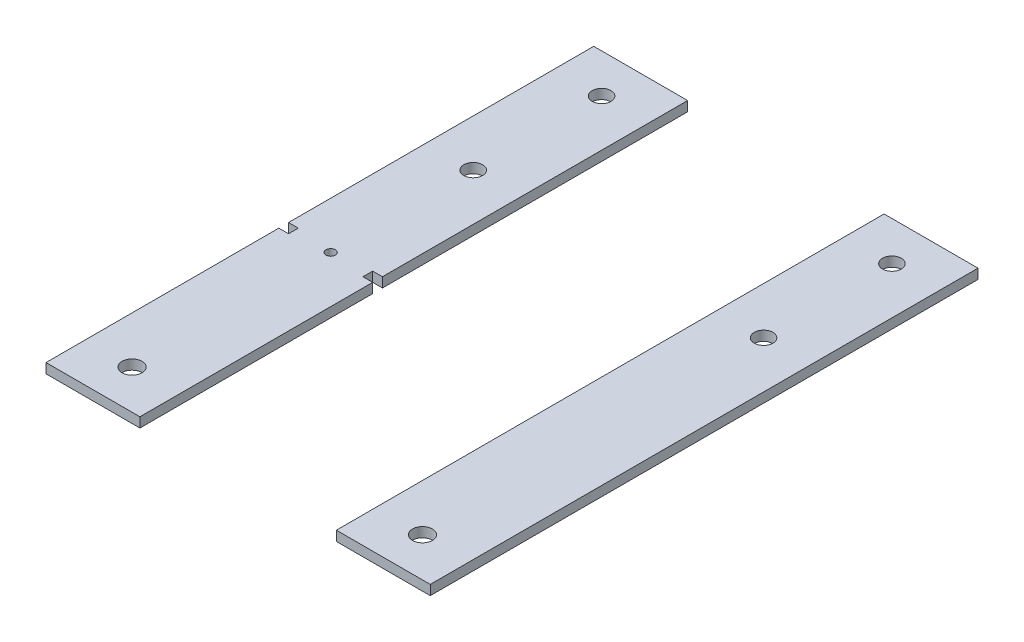
ISO-10303-21;
HEADER;
FILE_DESCRIPTION(('STEP AP214'),'2;1');
FILE_NAME('part.step','',(''),(''),'','','');
FILE_SCHEMA(('AUTOMOTIVE_DESIGN { 1 0 10303 214 1 1 1 1 }'));
ENDSEC;
DATA;
#1=APPLICATION_CONTEXT('core data for automotive mechanical design processes');
#2=APPLICATION_PROTOCOL_DEFINITION('international standard','automotive_design',2000,#1);
#3=PRODUCT_CONTEXT('',#1,'mechanical');
#4=PRODUCT('Part','Part','',(#3));
#5=PRODUCT_RELATED_PRODUCT_CATEGORY('part','',(#4));
#6=PRODUCT_DEFINITION_FORMATION('','',#4);
#7=PRODUCT_DEFINITION_CONTEXT('part definition',#1,'design');
#8=PRODUCT_DEFINITION('design','',#6,#7);
#9=PRODUCT_DEFINITION_SHAPE('','',#8);
#10=(LENGTH_UNIT() NAMED_UNIT(*) SI_UNIT(.MILLI.,.METRE.));
#11=(NAMED_UNIT(*) PLANE_ANGLE_UNIT() SI_UNIT($,.RADIAN.));
#12=(NAMED_UNIT(*) SI_UNIT($,.STERADIAN.) SOLID_ANGLE_UNIT());
#13=UNCERTAINTY_MEASURE_WITH_UNIT(LENGTH_MEASURE(1.E-05),#10,'distance_accuracy_value','');
#14=(GEOMETRIC_REPRESENTATION_CONTEXT(3) GLOBAL_UNCERTAINTY_ASSIGNED_CONTEXT((#13)) GLOBAL_UNIT_ASSIGNED_CONTEXT((#10,
#11,#12)) REPRESENTATION_CONTEXT('',''));
#15=CARTESIAN_POINT('',(0.,0.,0.));
#16=DIRECTION('',(0.,0.,1.));
#17=DIRECTION('',(1.,0.,0.));
#18=AXIS2_PLACEMENT_3D('',#15,#16,#17);
#19=CARTESIAN_POINT('',(-59.189999984,3.175,13.335));
#20=DIRECTION('',(0.,-1.,0.));
#21=DIRECTION('',(0.,0.,-1.));
#22=AXIS2_PLACEMENT_3D('',#19,#20,#21);
#23=PLANE('',#22);
#24=CARTESIAN_POINT('',(-47.1249999840005,3.175,11.7475));
#25=DIRECTION('',(0.,1.,0.));
#26=DIRECTION('',(0.,0.,1.));
#27=AXIS2_PLACEMENT_3D('',#24,#25,#26);
#28=CIRCLE('',#27,1.524);
#29=CARTESIAN_POINT('',(-47.1249999840005,3.175,13.2715));
#30=VERTEX_POINT('',#29);
#31=EDGE_CURVE('E302',#30,#30,#28,.T.);
#32=ORIENTED_EDGE('',*,*,#31,.F.);
#33=EDGE_LOOP('',(#32));
#34=FACE_BOUND('',#33,.T.);
#35=CARTESIAN_POINT('',(-47.1249999840002,3.175,-34.5292679999996));
#36=DIRECTION('',(0.,1.,0.));
#37=DIRECTION('',(0.,0.,-1.));
#38=AXIS2_PLACEMENT_3D('',#35,#36,#37);
#39=CIRCLE('',#38,3.048);
#40=CARTESIAN_POINT('',(-47.1249999840002,3.175,-37.5772679999996));
#41=VERTEX_POINT('',#40);
#42=EDGE_CURVE('E168',#41,#41,#39,.T.);
#43=ORIENTED_EDGE('',*,*,#42,.F.);
#44=EDGE_LOOP('',(#43));
#45=FACE_BOUND('',#44,.T.);
#46=DIRECTION('',(0.,0.,1.));
#47=VECTOR('',#46,1.);
#48=CARTESIAN_POINT('',(-59.189999984,3.175,10.16));
#49=LINE('',#48,#47);
#50=CARTESIAN_POINT('',(-59.189999984,3.175,10.16));
#51=VERTEX_POINT('',#50);
#52=CARTESIAN_POINT('',(-59.189999984,3.175,13.335));
#53=VERTEX_POINT('',#52);
#54=EDGE_CURVE('E187',#51,#53,#49,.T.);
#55=ORIENTED_EDGE('',*,*,#54,.T.);
#56=DIRECTION('',(-1.,0.,0.));
#57=VECTOR('',#56,1.);
#58=CARTESIAN_POINT('',(-59.189999984,3.175,13.335));
#59=LINE('',#58,#57);
#60=CARTESIAN_POINT('',(-62.364999984,3.175,13.335));
#61=VERTEX_POINT('',#60);
#62=EDGE_CURVE('E115',#53,#61,#59,.T.);
#63=ORIENTED_EDGE('',*,*,#62,.T.);
#64=DIRECTION('',(0.,0.,1.));
#65=VECTOR('',#64,1.);
#66=CARTESIAN_POINT('',(-62.364999984,3.175,13.335));
#67=LINE('',#66,#65);
#68=CARTESIAN_POINT('',(-62.364999984,3.175,88.9));
#69=VERTEX_POINT('',#68);
#70=EDGE_CURVE('E214',#61,#69,#67,.T.);
#71=ORIENTED_EDGE('',*,*,#70,.T.);
#72=DIRECTION('',(1.,0.,0.));
#73=VECTOR('',#72,1.);
#74=CARTESIAN_POINT('',(-31.884999984,3.175,88.9));
#75=LINE('',#74,#73);
#76=CARTESIAN_POINT('',(-31.884999984,3.175,88.9));
#77=VERTEX_POINT('',#76);
#78=EDGE_CURVE('E233',#69,#77,#75,.T.);
#79=ORIENTED_EDGE('',*,*,#78,.T.);
#80=DIRECTION('',(0.,0.,-1.));
#81=VECTOR('',#80,1.);
#82=CARTESIAN_POINT('',(-31.884999984,3.175,13.335));
#83=LINE('',#82,#81);
#84=CARTESIAN_POINT('',(-31.884999984,3.175,13.335));
#85=VERTEX_POINT('',#84);
#86=EDGE_CURVE('E230',#77,#85,#83,.T.);
#87=ORIENTED_EDGE('',*,*,#86,.T.);
#88=DIRECTION('',(-1.,0.,0.));
#89=VECTOR('',#88,1.);
#90=CARTESIAN_POINT('',(-31.884999984,3.175,13.335));
#91=LINE('',#90,#89);
#92=CARTESIAN_POINT('',(-35.059999984,3.175,13.335));
#93=VERTEX_POINT('',#92);
#94=EDGE_CURVE('E232',#85,#93,#91,.T.);
#95=ORIENTED_EDGE('',*,*,#94,.T.);
#96=DIRECTION('',(0.,0.,-1.));
#97=VECTOR('',#96,1.);
#98=CARTESIAN_POINT('',(-35.059999984,3.175,13.335));
#99=LINE('',#98,#97);
#100=CARTESIAN_POINT('',(-35.059999984,3.175,10.16));
#101=VERTEX_POINT('',#100);
#102=EDGE_CURVE('E235',#93,#101,#99,.T.);
#103=ORIENTED_EDGE('',*,*,#102,.T.);
#104=DIRECTION('',(1.,0.,0.));
#105=VECTOR('',#104,1.);
#106=CARTESIAN_POINT('',(-35.059999984,3.175,10.16));
#107=LINE('',#106,#105);
#108=CARTESIAN_POINT('',(-31.884999984,3.175,10.16));
#109=VERTEX_POINT('',#108);
#110=EDGE_CURVE('E241',#101,#109,#107,.T.);
#111=ORIENTED_EDGE('',*,*,#110,.T.);
#112=DIRECTION('',(0.,0.,-1.));
#113=VECTOR('',#112,1.);
#114=CARTESIAN_POINT('',(-31.884999984,3.175,-88.9));
#115=LINE('',#114,#113);
#116=CARTESIAN_POINT('',(-31.884999984,3.175,-88.9));
#117=VERTEX_POINT('',#116);
#118=EDGE_CURVE('E146',#109,#117,#115,.T.);
#119=ORIENTED_EDGE('',*,*,#118,.T.);
#120=DIRECTION('',(-1.,0.,0.));
#121=VECTOR('',#120,1.);
#122=CARTESIAN_POINT('',(-31.884999984,3.175,-88.9));
#123=LINE('',#122,#121);
#124=CARTESIAN_POINT('',(-62.364999984,3.175,-88.9));
#125=VERTEX_POINT('',#124);
#126=EDGE_CURVE('E140',#117,#125,#123,.T.);
#127=ORIENTED_EDGE('',*,*,#126,.T.);
#128=DIRECTION('',(0.,0.,1.));
#129=VECTOR('',#128,1.);
#130=CARTESIAN_POINT('',(-62.364999984,3.175,-88.9));
#131=LINE('',#130,#129);
#132=CARTESIAN_POINT('',(-62.364999984,3.175,10.16));
#133=VERTEX_POINT('',#132);
#134=EDGE_CURVE('E144',#125,#133,#131,.T.);
#135=ORIENTED_EDGE('',*,*,#134,.T.);
#136=DIRECTION('',(1.,0.,0.));
#137=VECTOR('',#136,1.);
#138=CARTESIAN_POINT('',(-62.364999984,3.175,10.16));
#139=LINE('',#138,#137);
#140=EDGE_CURVE('E60',#133,#51,#139,.T.);
#141=ORIENTED_EDGE('',*,*,#140,.T.);
#142=EDGE_LOOP('',(#55,#63,#71,#79,#87,#95,#103,#111,#119,#127,#135,#141));
#143=FACE_BOUND('',#142,.T.);
#144=CARTESIAN_POINT('',(-47.1249999840005,3.175,-76.1999999999995));
#145=DIRECTION('',(0.,1.,0.));
#146=DIRECTION('',(0.,0.,-1.));
#147=AXIS2_PLACEMENT_3D('',#144,#145,#146);
#148=CIRCLE('',#147,3.048);
#149=CARTESIAN_POINT('',(-47.1249999840005,3.175,-79.2479999999995));
#150=VERTEX_POINT('',#149);
#151=EDGE_CURVE('E308',#150,#150,#148,.T.);
#152=ORIENTED_EDGE('',*,*,#151,.F.);
#153=EDGE_LOOP('',(#152));
#154=FACE_BOUND('',#153,.T.);
#155=CARTESIAN_POINT('',(-47.1249999840001,3.175,76.2));
#156=DIRECTION('',(0.,1.,0.));
#157=DIRECTION('',(0.,0.,-1.));
#158=AXIS2_PLACEMENT_3D('',#155,#156,#157);
#159=CIRCLE('',#158,3.2385);
#160=CARTESIAN_POINT('',(-47.1249999840001,3.175,72.9615));
#161=VERTEX_POINT('',#160);
#162=EDGE_CURVE('E293',#161,#161,#159,.T.);
#163=ORIENTED_EDGE('',*,*,#162,.F.);
#164=EDGE_LOOP('',(#163));
#165=FACE_BOUND('',#164,.T.);
#166=ADVANCED_FACE('F43',(#34,#45,#143,#154,#165),#23,.F.);
#167=CARTESIAN_POINT('',(-59.189999984,0.,13.335));
#168=DIRECTION('',(0.,-1.,0.));
#169=DIRECTION('',(0.,0.,-1.));
#170=AXIS2_PLACEMENT_3D('',#167,#168,#169);
#171=PLANE('',#170);
#172=CARTESIAN_POINT('',(-47.1249999840005,0.,11.7475));
#173=DIRECTION('',(0.,1.,0.));
#174=DIRECTION('',(0.,0.,1.));
#175=AXIS2_PLACEMENT_3D('',#172,#173,#174);
#176=CIRCLE('',#175,1.524);
#177=CARTESIAN_POINT('',(-47.1249999840005,0.,13.2715));
#178=VERTEX_POINT('',#177);
#179=EDGE_CURVE('E299',#178,#178,#176,.T.);
#180=ORIENTED_EDGE('',*,*,#179,.T.);
#181=EDGE_LOOP('',(#180));
#182=FACE_BOUND('',#181,.T.);
#183=CARTESIAN_POINT('',(-47.1249999840002,0.,-34.5292679999996));
#184=DIRECTION('',(0.,1.,0.));
#185=DIRECTION('',(0.,0.,-1.));
#186=AXIS2_PLACEMENT_3D('',#183,#184,#185);
#187=CIRCLE('',#186,3.048);
#188=CARTESIAN_POINT('',(-47.1249999840002,0.,-37.5772679999996));
#189=VERTEX_POINT('',#188);
#190=EDGE_CURVE('E311',#189,#189,#187,.T.);
#191=ORIENTED_EDGE('',*,*,#190,.T.);
#192=EDGE_LOOP('',(#191));
#193=FACE_BOUND('',#192,.T.);
#194=DIRECTION('',(0.,0.,1.));
#195=VECTOR('',#194,1.);
#196=CARTESIAN_POINT('',(-59.189999984,0.,10.16));
#197=LINE('',#196,#195);
#198=CARTESIAN_POINT('',(-59.189999984,0.,10.16));
#199=VERTEX_POINT('',#198);
#200=CARTESIAN_POINT('',(-59.189999984,0.,13.335));
#201=VERTEX_POINT('',#200);
#202=EDGE_CURVE('E164',#199,#201,#197,.T.);
#203=ORIENTED_EDGE('',*,*,#202,.F.);
#204=DIRECTION('',(1.,0.,0.));
#205=VECTOR('',#204,1.);
#206=CARTESIAN_POINT('',(-62.364999984,0.,10.16));
#207=LINE('',#206,#205);
#208=CARTESIAN_POINT('',(-62.364999984,0.,10.16));
#209=VERTEX_POINT('',#208);
#210=EDGE_CURVE('E107',#209,#199,#207,.T.);
#211=ORIENTED_EDGE('',*,*,#210,.F.);
#212=DIRECTION('',(0.,0.,1.));
#213=VECTOR('',#212,1.);
#214=CARTESIAN_POINT('',(-62.364999984,0.,-88.9));
#215=LINE('',#214,#213);
#216=CARTESIAN_POINT('',(-62.364999984,0.,-88.9));
#217=VERTEX_POINT('',#216);
#218=EDGE_CURVE('E101',#217,#209,#215,.T.);
#219=ORIENTED_EDGE('',*,*,#218,.F.);
#220=DIRECTION('',(-1.,0.,0.));
#221=VECTOR('',#220,1.);
#222=CARTESIAN_POINT('',(-31.884999984,0.,-88.9));
#223=LINE('',#222,#221);
#224=CARTESIAN_POINT('',(-31.884999984,0.,-88.9));
#225=VERTEX_POINT('',#224);
#226=EDGE_CURVE('E154',#225,#217,#223,.T.);
#227=ORIENTED_EDGE('',*,*,#226,.F.);
#228=DIRECTION('',(0.,0.,-1.));
#229=VECTOR('',#228,1.);
#230=CARTESIAN_POINT('',(-31.884999984,0.,-88.9));
#231=LINE('',#230,#229);
#232=CARTESIAN_POINT('',(-31.884999984,0.,10.16));
#233=VERTEX_POINT('',#232);
#234=EDGE_CURVE('E182',#233,#225,#231,.T.);
#235=ORIENTED_EDGE('',*,*,#234,.F.);
#236=DIRECTION('',(1.,0.,0.));
#237=VECTOR('',#236,1.);
#238=CARTESIAN_POINT('',(-35.059999984,0.,10.16));
#239=LINE('',#238,#237);
#240=CARTESIAN_POINT('',(-35.059999984,0.,10.16));
#241=VERTEX_POINT('',#240);
#242=EDGE_CURVE('E180',#241,#233,#239,.T.);
#243=ORIENTED_EDGE('',*,*,#242,.F.);
#244=DIRECTION('',(0.,0.,-1.));
#245=VECTOR('',#244,1.);
#246=CARTESIAN_POINT('',(-35.059999984,0.,13.335));
#247=LINE('',#246,#245);
#248=CARTESIAN_POINT('',(-35.059999984,0.,13.335));
#249=VERTEX_POINT('',#248);
#250=EDGE_CURVE('E178',#249,#241,#247,.T.);
#251=ORIENTED_EDGE('',*,*,#250,.F.);
#252=DIRECTION('',(-1.,0.,0.));
#253=VECTOR('',#252,1.);
#254=CARTESIAN_POINT('',(-31.884999984,0.,13.335));
#255=LINE('',#254,#253);
#256=CARTESIAN_POINT('',(-31.884999984,0.,13.335));
#257=VERTEX_POINT('',#256);
#258=EDGE_CURVE('E176',#257,#249,#255,.T.);
#259=ORIENTED_EDGE('',*,*,#258,.F.);
#260=DIRECTION('',(0.,0.,-1.));
#261=VECTOR('',#260,1.);
#262=CARTESIAN_POINT('',(-31.884999984,0.,13.335));
#263=LINE('',#262,#261);
#264=CARTESIAN_POINT('',(-31.884999984,0.,88.9));
#265=VERTEX_POINT('',#264);
#266=EDGE_CURVE('E174',#265,#257,#263,.T.);
#267=ORIENTED_EDGE('',*,*,#266,.F.);
#268=DIRECTION('',(1.,0.,0.));
#269=VECTOR('',#268,1.);
#270=CARTESIAN_POINT('',(-31.884999984,0.,88.9));
#271=LINE('',#270,#269);
#272=CARTESIAN_POINT('',(-62.364999984,0.,88.9));
#273=VERTEX_POINT('',#272);
#274=EDGE_CURVE('E172',#273,#265,#271,.T.);
#275=ORIENTED_EDGE('',*,*,#274,.F.);
#276=DIRECTION('',(0.,0.,1.));
#277=VECTOR('',#276,1.);
#278=CARTESIAN_POINT('',(-62.364999984,0.,13.335));
#279=LINE('',#278,#277);
#280=CARTESIAN_POINT('',(-62.364999984,0.,13.335));
#281=VERTEX_POINT('',#280);
#282=EDGE_CURVE('E170',#281,#273,#279,.T.);
#283=ORIENTED_EDGE('',*,*,#282,.F.);
#284=DIRECTION('',(-1.,0.,0.));
#285=VECTOR('',#284,1.);
#286=CARTESIAN_POINT('',(-59.189999984,0.,13.335));
#287=LINE('',#286,#285);
#288=EDGE_CURVE('E167',#201,#281,#287,.T.);
#289=ORIENTED_EDGE('',*,*,#288,.F.);
#290=EDGE_LOOP('',(#203,#211,#219,#227,#235,#243,#251,#259,#267,#275,#283,#289));
#291=FACE_BOUND('',#290,.T.);
#292=CARTESIAN_POINT('',(-47.1249999840005,0.,-76.1999999999995));
#293=DIRECTION('',(0.,1.,0.));
#294=DIRECTION('',(0.,0.,-1.));
#295=AXIS2_PLACEMENT_3D('',#292,#293,#294);
#296=CIRCLE('',#295,3.048);
#297=CARTESIAN_POINT('',(-47.1249999840005,0.,-79.2479999999995));
#298=VERTEX_POINT('',#297);
#299=EDGE_CURVE('E305',#298,#298,#296,.T.);
#300=ORIENTED_EDGE('',*,*,#299,.T.);
#301=EDGE_LOOP('',(#300));
#302=FACE_BOUND('',#301,.T.);
#303=CARTESIAN_POINT('',(-47.1249999840001,0.,76.2));
#304=DIRECTION('',(0.,1.,0.));
#305=DIRECTION('',(0.,0.,-1.));
#306=AXIS2_PLACEMENT_3D('',#303,#304,#305);
#307=CIRCLE('',#306,3.2385);
#308=CARTESIAN_POINT('',(-47.1249999840001,0.,72.9615));
#309=VERTEX_POINT('',#308);
#310=EDGE_CURVE('E296',#309,#309,#307,.T.);
#311=ORIENTED_EDGE('',*,*,#310,.T.);
#312=EDGE_LOOP('',(#311));
#313=FACE_BOUND('',#312,.T.);
#314=ADVANCED_FACE('F218',(#182,#193,#291,#302,#313),#171,.T.);
#315=CARTESIAN_POINT('',(-59.189999984,3.175,10.16));
#316=DIRECTION('',(1.,0.,0.));
#317=DIRECTION('',(0.,0.,-1.));
#318=AXIS2_PLACEMENT_3D('',#315,#316,#317);
#319=PLANE('',#318);
#320=ORIENTED_EDGE('',*,*,#202,.T.);
#321=DIRECTION('',(0.,-1.,0.));
#322=VECTOR('',#321,1.);
#323=CARTESIAN_POINT('',(-59.189999984,3.175,13.335));
#324=LINE('',#323,#322);
#325=EDGE_CURVE('E12',#53,#201,#324,.T.);
#326=ORIENTED_EDGE('',*,*,#325,.F.);
#327=ORIENTED_EDGE('',*,*,#54,.F.);
#328=DIRECTION('',(0.,-1.,0.));
#329=VECTOR('',#328,1.);
#330=CARTESIAN_POINT('',(-59.189999984,3.175,10.16));
#331=LINE('',#330,#329);
#332=EDGE_CURVE('E160',#51,#199,#331,.T.);
#333=ORIENTED_EDGE('',*,*,#332,.T.);
#334=EDGE_LOOP('',(#320,#326,#327,#333));
#335=FACE_BOUND('',#334,.T.);
#336=ADVANCED_FACE('F45',(#335),#319,.F.);
#337=CARTESIAN_POINT('',(-59.189999984,3.175,13.335));
#338=DIRECTION('',(0.,0.,1.));
#339=DIRECTION('',(1.,0.,0.));
#340=AXIS2_PLACEMENT_3D('',#337,#338,#339);
#341=PLANE('',#340);
#342=ORIENTED_EDGE('',*,*,#288,.T.);
#343=DIRECTION('',(0.,-1.,0.));
#344=VECTOR('',#343,1.);
#345=CARTESIAN_POINT('',(-62.364999984,3.175,13.335));
#346=LINE('',#345,#344);
#347=EDGE_CURVE('E52',#61,#281,#346,.T.);
#348=ORIENTED_EDGE('',*,*,#347,.F.);
#349=ORIENTED_EDGE('',*,*,#62,.F.);
#350=ORIENTED_EDGE('',*,*,#325,.T.);
#351=EDGE_LOOP('',(#342,#348,#349,#350));
#352=FACE_BOUND('',#351,.T.);
#353=ADVANCED_FACE('F420',(#352),#341,.F.);
#354=CARTESIAN_POINT('',(-62.364999984,3.175,13.335));
#355=DIRECTION('',(1.,0.,0.));
#356=DIRECTION('',(0.,0.,-1.));
#357=AXIS2_PLACEMENT_3D('',#354,#355,#356);
#358=PLANE('',#357);
#359=ORIENTED_EDGE('',*,*,#282,.T.);
#360=DIRECTION('',(0.,-1.,0.));
#361=VECTOR('',#360,1.);
#362=CARTESIAN_POINT('',(-62.364999984,3.175,88.9));
#363=LINE('',#362,#361);
#364=EDGE_CURVE('E206',#69,#273,#363,.T.);
#365=ORIENTED_EDGE('',*,*,#364,.F.);
#366=ORIENTED_EDGE('',*,*,#70,.F.);
#367=ORIENTED_EDGE('',*,*,#347,.T.);
#368=EDGE_LOOP('',(#359,#365,#366,#367));
#369=FACE_BOUND('',#368,.T.);
#370=ADVANCED_FACE('F212',(#369),#358,.F.);
#371=CARTESIAN_POINT('',(-31.884999984,3.175,88.9));
#372=DIRECTION('',(0.,0.,-1.));
#373=DIRECTION('',(-1.,0.,0.));
#374=AXIS2_PLACEMENT_3D('',#371,#372,#373);
#375=PLANE('',#374);
#376=ORIENTED_EDGE('',*,*,#274,.T.);
#377=DIRECTION('',(0.,-1.,0.));
#378=VECTOR('',#377,1.);
#379=CARTESIAN_POINT('',(-31.884999984,3.175,88.9));
#380=LINE('',#379,#378);
#381=EDGE_CURVE('E203',#77,#265,#380,.T.);
#382=ORIENTED_EDGE('',*,*,#381,.F.);
#383=ORIENTED_EDGE('',*,*,#78,.F.);
#384=ORIENTED_EDGE('',*,*,#364,.T.);
#385=EDGE_LOOP('',(#376,#382,#383,#384));
#386=FACE_BOUND('',#385,.T.);
#387=ADVANCED_FACE('F224',(#386),#375,.F.);
#388=CARTESIAN_POINT('',(-31.884999984,3.175,13.335));
#389=DIRECTION('',(-1.,0.,0.));
#390=DIRECTION('',(0.,0.,1.));
#391=AXIS2_PLACEMENT_3D('',#388,#389,#390);
#392=PLANE('',#391);
#393=ORIENTED_EDGE('',*,*,#266,.T.);
#394=DIRECTION('',(0.,-1.,0.));
#395=VECTOR('',#394,1.);
#396=CARTESIAN_POINT('',(-31.884999984,3.175,13.335));
#397=LINE('',#396,#395);
#398=EDGE_CURVE('E200',#85,#257,#397,.T.);
#399=ORIENTED_EDGE('',*,*,#398,.F.);
#400=ORIENTED_EDGE('',*,*,#86,.F.);
#401=ORIENTED_EDGE('',*,*,#381,.T.);
#402=EDGE_LOOP('',(#393,#399,#400,#401));
#403=FACE_BOUND('',#402,.T.);
#404=ADVANCED_FACE('F228',(#403),#392,.F.);
#405=CARTESIAN_POINT('',(-31.884999984,3.175,13.335));
#406=DIRECTION('',(0.,0.,1.));
#407=DIRECTION('',(1.,0.,0.));
#408=AXIS2_PLACEMENT_3D('',#405,#406,#407);
#409=PLANE('',#408);
#410=ORIENTED_EDGE('',*,*,#258,.T.);
#411=DIRECTION('',(0.,-1.,0.));
#412=VECTOR('',#411,1.);
#413=CARTESIAN_POINT('',(-35.059999984,3.175,13.335));
#414=LINE('',#413,#412);
#415=EDGE_CURVE('E197',#93,#249,#414,.T.);
#416=ORIENTED_EDGE('',*,*,#415,.F.);
#417=ORIENTED_EDGE('',*,*,#94,.F.);
#418=ORIENTED_EDGE('',*,*,#398,.T.);
#419=EDGE_LOOP('',(#410,#416,#417,#418));
#420=FACE_BOUND('',#419,.T.);
#421=ADVANCED_FACE('F385',(#420),#409,.F.);
#422=CARTESIAN_POINT('',(-35.059999984,3.175,13.335));
#423=DIRECTION('',(-1.,0.,0.));
#424=DIRECTION('',(0.,0.,1.));
#425=AXIS2_PLACEMENT_3D('',#422,#423,#424);
#426=PLANE('',#425);
#427=ORIENTED_EDGE('',*,*,#250,.T.);
#428=DIRECTION('',(0.,-1.,0.));
#429=VECTOR('',#428,1.);
#430=CARTESIAN_POINT('',(-35.059999984,3.175,10.16));
#431=LINE('',#430,#429);
#432=EDGE_CURVE('E194',#101,#241,#431,.T.);
#433=ORIENTED_EDGE('',*,*,#432,.F.);
#434=ORIENTED_EDGE('',*,*,#102,.F.);
#435=ORIENTED_EDGE('',*,*,#415,.T.);
#436=EDGE_LOOP('',(#427,#433,#434,#435));
#437=FACE_BOUND('',#436,.T.);
#438=ADVANCED_FACE('F376',(#437),#426,.F.);
#439=CARTESIAN_POINT('',(-35.059999984,3.175,10.16));
#440=DIRECTION('',(0.,0.,-1.));
#441=DIRECTION('',(-1.,0.,0.));
#442=AXIS2_PLACEMENT_3D('',#439,#440,#441);
#443=PLANE('',#442);
#444=ORIENTED_EDGE('',*,*,#242,.T.);
#445=DIRECTION('',(0.,-1.,0.));
#446=VECTOR('',#445,1.);
#447=CARTESIAN_POINT('',(-31.884999984,3.175,10.16));
#448=LINE('',#447,#446);
#449=EDGE_CURVE('E191',#109,#233,#448,.T.);
#450=ORIENTED_EDGE('',*,*,#449,.F.);
#451=ORIENTED_EDGE('',*,*,#110,.F.);
#452=ORIENTED_EDGE('',*,*,#432,.T.);
#453=EDGE_LOOP('',(#444,#450,#451,#452));
#454=FACE_BOUND('',#453,.T.);
#455=ADVANCED_FACE('F247',(#454),#443,.F.);
#456=CARTESIAN_POINT('',(-31.884999984,3.175,-88.9));
#457=DIRECTION('',(-1.,0.,0.));
#458=DIRECTION('',(0.,0.,1.));
#459=AXIS2_PLACEMENT_3D('',#456,#457,#458);
#460=PLANE('',#459);
#461=ORIENTED_EDGE('',*,*,#234,.T.);
#462=DIRECTION('',(0.,-1.,0.));
#463=VECTOR('',#462,1.);
#464=CARTESIAN_POINT('',(-31.884999984,3.175,-88.9));
#465=LINE('',#464,#463);
#466=EDGE_CURVE('E155',#117,#225,#465,.T.);
#467=ORIENTED_EDGE('',*,*,#466,.F.);
#468=ORIENTED_EDGE('',*,*,#118,.F.);
#469=ORIENTED_EDGE('',*,*,#449,.T.);
#470=EDGE_LOOP('',(#461,#467,#468,#469));
#471=FACE_BOUND('',#470,.T.);
#472=ADVANCED_FACE('F251',(#471),#460,.F.);
#473=CARTESIAN_POINT('',(-31.884999984,3.175,-88.9));
#474=DIRECTION('',(0.,0.,1.));
#475=DIRECTION('',(1.,0.,0.));
#476=AXIS2_PLACEMENT_3D('',#473,#474,#475);
#477=PLANE('',#476);
#478=ORIENTED_EDGE('',*,*,#226,.T.);
#479=DIRECTION('',(0.,-1.,0.));
#480=VECTOR('',#479,1.);
#481=CARTESIAN_POINT('',(-62.364999984,3.175,-88.9));
#482=LINE('',#481,#480);
#483=EDGE_CURVE('E151',#125,#217,#482,.T.);
#484=ORIENTED_EDGE('',*,*,#483,.F.);
#485=ORIENTED_EDGE('',*,*,#126,.F.);
#486=ORIENTED_EDGE('',*,*,#466,.T.);
#487=EDGE_LOOP('',(#478,#484,#485,#486));
#488=FACE_BOUND('',#487,.T.);
#489=ADVANCED_FACE('F152',(#488),#477,.F.);
#490=CARTESIAN_POINT('',(-62.364999984,3.175,-88.9));
#491=DIRECTION('',(1.,0.,0.));
#492=DIRECTION('',(0.,0.,-1.));
#493=AXIS2_PLACEMENT_3D('',#490,#491,#492);
#494=PLANE('',#493);
#495=ORIENTED_EDGE('',*,*,#218,.T.);
#496=DIRECTION('',(0.,-1.,0.));
#497=VECTOR('',#496,1.);
#498=CARTESIAN_POINT('',(-62.364999984,3.175,10.16));
#499=LINE('',#498,#497);
#500=EDGE_CURVE('E156',#133,#209,#499,.T.);
#501=ORIENTED_EDGE('',*,*,#500,.F.);
#502=ORIENTED_EDGE('',*,*,#134,.F.);
#503=ORIENTED_EDGE('',*,*,#483,.T.);
#504=EDGE_LOOP('',(#495,#501,#502,#503));
#505=FACE_BOUND('',#504,.T.);
#506=ADVANCED_FACE('F158',(#505),#494,.F.);
#507=CARTESIAN_POINT('',(-62.364999984,3.175,10.16));
#508=DIRECTION('',(0.,0.,-1.));
#509=DIRECTION('',(-1.,0.,0.));
#510=AXIS2_PLACEMENT_3D('',#507,#508,#509);
#511=PLANE('',#510);
#512=ORIENTED_EDGE('',*,*,#210,.T.);
#513=ORIENTED_EDGE('',*,*,#332,.F.);
#514=ORIENTED_EDGE('',*,*,#140,.F.);
#515=ORIENTED_EDGE('',*,*,#500,.T.);
#516=EDGE_LOOP('',(#512,#513,#514,#515));
#517=FACE_BOUND('',#516,.T.);
#518=ADVANCED_FACE('F255',(#517),#511,.F.);
#519=CARTESIAN_POINT('',(-47.1249999840002,3.175,-34.5292679999996));
#520=DIRECTION('',(0.,-1.,0.));
#521=DIRECTION('',(0.,0.,-1.));
#522=AXIS2_PLACEMENT_3D('',#519,#520,#521);
#523=CYLINDRICAL_SURFACE('',#522,3.048);
#524=ORIENTED_EDGE('',*,*,#42,.T.);
#525=EDGE_LOOP('',(#524));
#526=FACE_BOUND('',#525,.T.);
#527=ORIENTED_EDGE('',*,*,#190,.F.);
#528=EDGE_LOOP('',(#527));
#529=FACE_BOUND('',#528,.T.);
#530=ADVANCED_FACE('F257',(#526,#529),#523,.F.);
#531=CARTESIAN_POINT('',(-47.1249999840005,3.175,-76.1999999999995));
#532=DIRECTION('',(0.,-1.,0.));
#533=DIRECTION('',(0.,0.,-1.));
#534=AXIS2_PLACEMENT_3D('',#531,#532,#533);
#535=CYLINDRICAL_SURFACE('',#534,3.048);
#536=ORIENTED_EDGE('',*,*,#151,.T.);
#537=EDGE_LOOP('',(#536));
#538=FACE_BOUND('',#537,.T.);
#539=ORIENTED_EDGE('',*,*,#299,.F.);
#540=EDGE_LOOP('',(#539));
#541=FACE_BOUND('',#540,.T.);
#542=ADVANCED_FACE('F263',(#538,#541),#535,.F.);
#543=CARTESIAN_POINT('',(-47.1249999840005,3.175,11.7475));
#544=DIRECTION('',(0.,-1.,0.));
#545=DIRECTION('',(0.,0.,-1.));
#546=AXIS2_PLACEMENT_3D('',#543,#544,#545);
#547=CYLINDRICAL_SURFACE('',#546,1.524);
#548=ORIENTED_EDGE('',*,*,#31,.T.);
#549=EDGE_LOOP('',(#548));
#550=FACE_BOUND('',#549,.T.);
#551=ORIENTED_EDGE('',*,*,#179,.F.);
#552=EDGE_LOOP('',(#551));
#553=FACE_BOUND('',#552,.T.);
#554=ADVANCED_FACE('F280',(#550,#553),#547,.F.);
#555=CARTESIAN_POINT('',(-47.1249999840001,3.175,76.2));
#556=DIRECTION('',(0.,-1.,0.));
#557=DIRECTION('',(0.,0.,-1.));
#558=AXIS2_PLACEMENT_3D('',#555,#556,#557);
#559=CYLINDRICAL_SURFACE('',#558,3.2385);
#560=ORIENTED_EDGE('',*,*,#162,.T.);
#561=EDGE_LOOP('',(#560));
#562=FACE_BOUND('',#561,.T.);
#563=ORIENTED_EDGE('',*,*,#310,.F.);
#564=EDGE_LOOP('',(#563));
#565=FACE_BOUND('',#564,.T.);
#566=ADVANCED_FACE('F284',(#562,#565),#559,.F.);
#567=CLOSED_SHELL('',(#166,#314,#336,#353,#370,#387,#404,#421,#438,#455,#472,#489,#506,#518,
#530,#542,#554,#566));
#568=MANIFOLD_SOLID_BREP('B2',#567);
#569=CARTESIAN_POINT('',(62.364999984,3.175,88.9));
#570=DIRECTION('',(0.,-1.,0.));
#571=DIRECTION('',(0.,0.,-1.));
#572=AXIS2_PLACEMENT_3D('',#569,#570,#571);
#573=PLANE('',#572);
#574=CARTESIAN_POINT('',(47.124999984,3.175,-34.529268));
#575=DIRECTION('',(0.,1.,0.));
#576=DIRECTION('',(0.,0.,1.));
#577=AXIS2_PLACEMENT_3D('',#574,#575,#576);
#578=CIRCLE('',#577,3.048);
#579=CARTESIAN_POINT('',(47.124999984,3.175,-31.481268));
#580=VERTEX_POINT('',#579);
#581=EDGE_CURVE('E541',#580,#580,#578,.T.);
#582=ORIENTED_EDGE('',*,*,#581,.F.);
#583=EDGE_LOOP('',(#582));
#584=FACE_BOUND('',#583,.T.);
#585=DIRECTION('',(1.,0.,0.));
#586=VECTOR('',#585,1.);
#587=CARTESIAN_POINT('',(31.884999984,3.175,88.9));
#588=LINE('',#587,#586);
#589=CARTESIAN_POINT('',(31.884999984,3.175,88.9));
#590=VERTEX_POINT('',#589);
#591=CARTESIAN_POINT('',(62.364999984,3.175,88.9));
#592=VERTEX_POINT('',#591);
#593=EDGE_CURVE('E511',#590,#592,#588,.T.);
#594=ORIENTED_EDGE('',*,*,#593,.T.);
#595=DIRECTION('',(0.,0.,-1.));
#596=VECTOR('',#595,1.);
#597=CARTESIAN_POINT('',(62.364999984,3.175,-88.9));
#598=LINE('',#597,#596);
#599=CARTESIAN_POINT('',(62.364999984,3.175,-88.9));
#600=VERTEX_POINT('',#599);
#601=EDGE_CURVE('E506',#592,#600,#598,.T.);
#602=ORIENTED_EDGE('',*,*,#601,.T.);
#603=DIRECTION('',(-1.,0.,0.));
#604=VECTOR('',#603,1.);
#605=CARTESIAN_POINT('',(31.884999984,3.175,-88.9));
#606=LINE('',#605,#604);
#607=CARTESIAN_POINT('',(31.884999984,3.175,-88.9));
#608=VERTEX_POINT('',#607);
#609=EDGE_CURVE('E509',#600,#608,#606,.T.);
#610=ORIENTED_EDGE('',*,*,#609,.T.);
#611=DIRECTION('',(0.,0.,1.));
#612=VECTOR('',#611,1.);
#613=CARTESIAN_POINT('',(31.884999984,3.175,-88.9));
#614=LINE('',#613,#612);
#615=EDGE_CURVE('E476',#608,#590,#614,.T.);
#616=ORIENTED_EDGE('',*,*,#615,.T.);
#617=EDGE_LOOP('',(#594,#602,#610,#616));
#618=FACE_BOUND('',#617,.T.);
#619=CARTESIAN_POINT('',(47.124999984,3.175,-76.2));
#620=DIRECTION('',(0.,1.,0.));
#621=DIRECTION('',(0.,0.,1.));
#622=AXIS2_PLACEMENT_3D('',#619,#620,#621);
#623=CIRCLE('',#622,3.048);
#624=CARTESIAN_POINT('',(47.124999984,3.175,-73.152));
#625=VERTEX_POINT('',#624);
#626=EDGE_CURVE('E526',#625,#625,#623,.T.);
#627=ORIENTED_EDGE('',*,*,#626,.F.);
#628=EDGE_LOOP('',(#627));
#629=FACE_BOUND('',#628,.T.);
#630=CARTESIAN_POINT('',(47.1249999840001,3.175,76.2));
#631=DIRECTION('',(0.,1.,0.));
#632=DIRECTION('',(0.,0.,1.));
#633=AXIS2_PLACEMENT_3D('',#630,#631,#632);
#634=CIRCLE('',#633,3.2385);
#635=CARTESIAN_POINT('',(47.1249999840001,3.175,79.4385));
#636=VERTEX_POINT('',#635);
#637=EDGE_CURVE('E547',#636,#636,#634,.T.);
#638=ORIENTED_EDGE('',*,*,#637,.F.);
#639=EDGE_LOOP('',(#638));
#640=FACE_BOUND('',#639,.T.);
#641=ADVANCED_FACE('F459',(#584,#618,#629,#640),#573,.F.);
#642=CARTESIAN_POINT('',(62.364999984,0.,88.9));
#643=DIRECTION('',(0.,-1.,0.));
#644=DIRECTION('',(0.,0.,-1.));
#645=AXIS2_PLACEMENT_3D('',#642,#643,#644);
#646=PLANE('',#645);
#647=CARTESIAN_POINT('',(47.124999984,0.,-34.529268));
#648=DIRECTION('',(0.,1.,0.));
#649=DIRECTION('',(0.,0.,1.));
#650=AXIS2_PLACEMENT_3D('',#647,#648,#649);
#651=CIRCLE('',#650,3.048);
#652=CARTESIAN_POINT('',(47.124999984,0.,-31.481268));
#653=VERTEX_POINT('',#652);
#654=EDGE_CURVE('E544',#653,#653,#651,.T.);
#655=ORIENTED_EDGE('',*,*,#654,.T.);
#656=EDGE_LOOP('',(#655));
#657=FACE_BOUND('',#656,.T.);
#658=DIRECTION('',(1.,0.,0.));
#659=VECTOR('',#658,1.);
#660=CARTESIAN_POINT('',(31.884999984,0.,88.9));
#661=LINE('',#660,#659);
#662=CARTESIAN_POINT('',(31.884999984,0.,88.9));
#663=VERTEX_POINT('',#662);
#664=CARTESIAN_POINT('',(62.364999984,0.,88.9));
#665=VERTEX_POINT('',#664);
#666=EDGE_CURVE('E523',#663,#665,#661,.T.);
#667=ORIENTED_EDGE('',*,*,#666,.F.);
#668=DIRECTION('',(0.,0.,1.));
#669=VECTOR('',#668,1.);
#670=CARTESIAN_POINT('',(31.884999984,0.,-88.9));
#671=LINE('',#670,#669);
#672=CARTESIAN_POINT('',(31.884999984,0.,-88.9));
#673=VERTEX_POINT('',#672);
#674=EDGE_CURVE('E499',#673,#663,#671,.T.);
#675=ORIENTED_EDGE('',*,*,#674,.F.);
#676=DIRECTION('',(-1.,0.,0.));
#677=VECTOR('',#676,1.);
#678=CARTESIAN_POINT('',(31.884999984,0.,-88.9));
#679=LINE('',#678,#677);
#680=CARTESIAN_POINT('',(62.364999984,0.,-88.9));
#681=VERTEX_POINT('',#680);
#682=EDGE_CURVE('E493',#681,#673,#679,.T.);
#683=ORIENTED_EDGE('',*,*,#682,.F.);
#684=DIRECTION('',(0.,0.,-1.));
#685=VECTOR('',#684,1.);
#686=CARTESIAN_POINT('',(62.364999984,0.,-88.9));
#687=LINE('',#686,#685);
#688=EDGE_CURVE('E515',#665,#681,#687,.T.);
#689=ORIENTED_EDGE('',*,*,#688,.F.);
#690=EDGE_LOOP('',(#667,#675,#683,#689));
#691=FACE_BOUND('',#690,.T.);
#692=CARTESIAN_POINT('',(47.124999984,0.,-76.2));
#693=DIRECTION('',(0.,1.,0.));
#694=DIRECTION('',(0.,0.,1.));
#695=AXIS2_PLACEMENT_3D('',#692,#693,#694);
#696=CIRCLE('',#695,3.048);
#697=CARTESIAN_POINT('',(47.124999984,0.,-73.152));
#698=VERTEX_POINT('',#697);
#699=EDGE_CURVE('E538',#698,#698,#696,.T.);
#700=ORIENTED_EDGE('',*,*,#699,.T.);
#701=EDGE_LOOP('',(#700));
#702=FACE_BOUND('',#701,.T.);
#703=CARTESIAN_POINT('',(47.1249999840001,0.,76.2));
#704=DIRECTION('',(0.,1.,0.));
#705=DIRECTION('',(0.,0.,1.));
#706=AXIS2_PLACEMENT_3D('',#703,#704,#705);
#707=CIRCLE('',#706,3.2385);
#708=CARTESIAN_POINT('',(47.1249999840001,0.,79.4385));
#709=VERTEX_POINT('',#708);
#710=EDGE_CURVE('E550',#709,#709,#707,.T.);
#711=ORIENTED_EDGE('',*,*,#710,.T.);
#712=EDGE_LOOP('',(#711));
#713=FACE_BOUND('',#712,.T.);
#714=ADVANCED_FACE('F534',(#657,#691,#702,#713),#646,.T.);
#715=CARTESIAN_POINT('',(31.884999984,3.175,88.9));
#716=DIRECTION('',(0.,0.,-1.));
#717=DIRECTION('',(-1.,0.,0.));
#718=AXIS2_PLACEMENT_3D('',#715,#716,#717);
#719=PLANE('',#718);
#720=ORIENTED_EDGE('',*,*,#666,.T.);
#721=DIRECTION('',(0.,-1.,0.));
#722=VECTOR('',#721,1.);
#723=CARTESIAN_POINT('',(62.364999984,3.175,88.9));
#724=LINE('',#723,#722);
#725=EDGE_CURVE('E41',#592,#665,#724,.T.);
#726=ORIENTED_EDGE('',*,*,#725,.F.);
#727=ORIENTED_EDGE('',*,*,#593,.F.);
#728=DIRECTION('',(0.,-1.,0.));
#729=VECTOR('',#728,1.);
#730=CARTESIAN_POINT('',(31.884999984,3.175,88.9));
#731=LINE('',#730,#729);
#732=EDGE_CURVE('E519',#590,#663,#731,.T.);
#733=ORIENTED_EDGE('',*,*,#732,.T.);
#734=EDGE_LOOP('',(#720,#726,#727,#733));
#735=FACE_BOUND('',#734,.T.);
#736=ADVANCED_FACE('F461',(#735),#719,.F.);
#737=CARTESIAN_POINT('',(62.364999984,3.175,-88.9));
#738=DIRECTION('',(-1.,0.,0.));
#739=DIRECTION('',(0.,0.,1.));
#740=AXIS2_PLACEMENT_3D('',#737,#738,#739);
#741=PLANE('',#740);
#742=ORIENTED_EDGE('',*,*,#688,.T.);
#743=DIRECTION('',(0.,-1.,0.));
#744=VECTOR('',#743,1.);
#745=CARTESIAN_POINT('',(62.364999984,3.175,-88.9));
#746=LINE('',#745,#744);
#747=EDGE_CURVE('E468',#600,#681,#746,.T.);
#748=ORIENTED_EDGE('',*,*,#747,.F.);
#749=ORIENTED_EDGE('',*,*,#601,.F.);
#750=ORIENTED_EDGE('',*,*,#725,.T.);
#751=EDGE_LOOP('',(#742,#748,#749,#750));
#752=FACE_BOUND('',#751,.T.);
#753=ADVANCED_FACE('F514',(#752),#741,.F.);
#754=CARTESIAN_POINT('',(31.884999984,3.175,-88.9));
#755=DIRECTION('',(0.,0.,1.));
#756=DIRECTION('',(1.,0.,0.));
#757=AXIS2_PLACEMENT_3D('',#754,#755,#756);
#758=PLANE('',#757);
#759=ORIENTED_EDGE('',*,*,#682,.T.);
#760=DIRECTION('',(0.,-1.,0.));
#761=VECTOR('',#760,1.);
#762=CARTESIAN_POINT('',(31.884999984,3.175,-88.9));
#763=LINE('',#762,#761);
#764=EDGE_CURVE('E516',#608,#673,#763,.T.);
#765=ORIENTED_EDGE('',*,*,#764,.F.);
#766=ORIENTED_EDGE('',*,*,#609,.F.);
#767=ORIENTED_EDGE('',*,*,#747,.T.);
#768=EDGE_LOOP('',(#759,#765,#766,#767));
#769=FACE_BOUND('',#768,.T.);
#770=ADVANCED_FACE('F517',(#769),#758,.F.);
#771=CARTESIAN_POINT('',(31.884999984,3.175,-88.9));
#772=DIRECTION('',(1.,0.,0.));
#773=DIRECTION('',(0.,0.,-1.));
#774=AXIS2_PLACEMENT_3D('',#771,#772,#773);
#775=PLANE('',#774);
#776=ORIENTED_EDGE('',*,*,#674,.T.);
#777=ORIENTED_EDGE('',*,*,#732,.F.);
#778=ORIENTED_EDGE('',*,*,#615,.F.);
#779=ORIENTED_EDGE('',*,*,#764,.T.);
#780=EDGE_LOOP('',(#776,#777,#778,#779));
#781=FACE_BOUND('',#780,.T.);
#782=ADVANCED_FACE('F531',(#781),#775,.F.);
#783=CARTESIAN_POINT('',(47.124999984,3.175,-76.2));
#784=DIRECTION('',(0.,-1.,0.));
#785=DIRECTION('',(0.,0.,-1.));
#786=AXIS2_PLACEMENT_3D('',#783,#784,#785);
#787=CYLINDRICAL_SURFACE('',#786,3.048);
#788=ORIENTED_EDGE('',*,*,#626,.T.);
#789=EDGE_LOOP('',(#788));
#790=FACE_BOUND('',#789,.T.);
#791=ORIENTED_EDGE('',*,*,#699,.F.);
#792=EDGE_LOOP('',(#791));
#793=FACE_BOUND('',#792,.T.);
#794=ADVANCED_FACE('F569',(#790,#793),#787,.F.);
#795=CARTESIAN_POINT('',(47.124999984,3.175,-34.529268));
#796=DIRECTION('',(0.,-1.,0.));
#797=DIRECTION('',(0.,0.,-1.));
#798=AXIS2_PLACEMENT_3D('',#795,#796,#797);
#799=CYLINDRICAL_SURFACE('',#798,3.048);
#800=ORIENTED_EDGE('',*,*,#581,.T.);
#801=EDGE_LOOP('',(#800));
#802=FACE_BOUND('',#801,.T.);
#803=ORIENTED_EDGE('',*,*,#654,.F.);
#804=EDGE_LOOP('',(#803));
#805=FACE_BOUND('',#804,.T.);
#806=ADVANCED_FACE('F615',(#802,#805),#799,.F.);
#807=CARTESIAN_POINT('',(47.1249999840001,3.175,76.2));
#808=DIRECTION('',(0.,-1.,0.));
#809=DIRECTION('',(0.,0.,-1.));
#810=AXIS2_PLACEMENT_3D('',#807,#808,#809);
#811=CYLINDRICAL_SURFACE('',#810,3.2385);
#812=ORIENTED_EDGE('',*,*,#637,.T.);
#813=EDGE_LOOP('',(#812));
#814=FACE_BOUND('',#813,.T.);
#815=ORIENTED_EDGE('',*,*,#710,.F.);
#816=EDGE_LOOP('',(#815));
#817=FACE_BOUND('',#816,.T.);
#818=ADVANCED_FACE('F556',(#814,#817),#811,.F.);
#819=CLOSED_SHELL('',(#641,#714,#736,#753,#770,#782,#794,#806,#818));
#820=MANIFOLD_SOLID_BREP('B6',#819);
#821=ADVANCED_BREP_SHAPE_REPRESENTATION('',(#18,#568,#820),#14);
#822=SHAPE_DEFINITION_REPRESENTATION(#9,#821);
ENDSEC;
END-ISO-10303-21;
